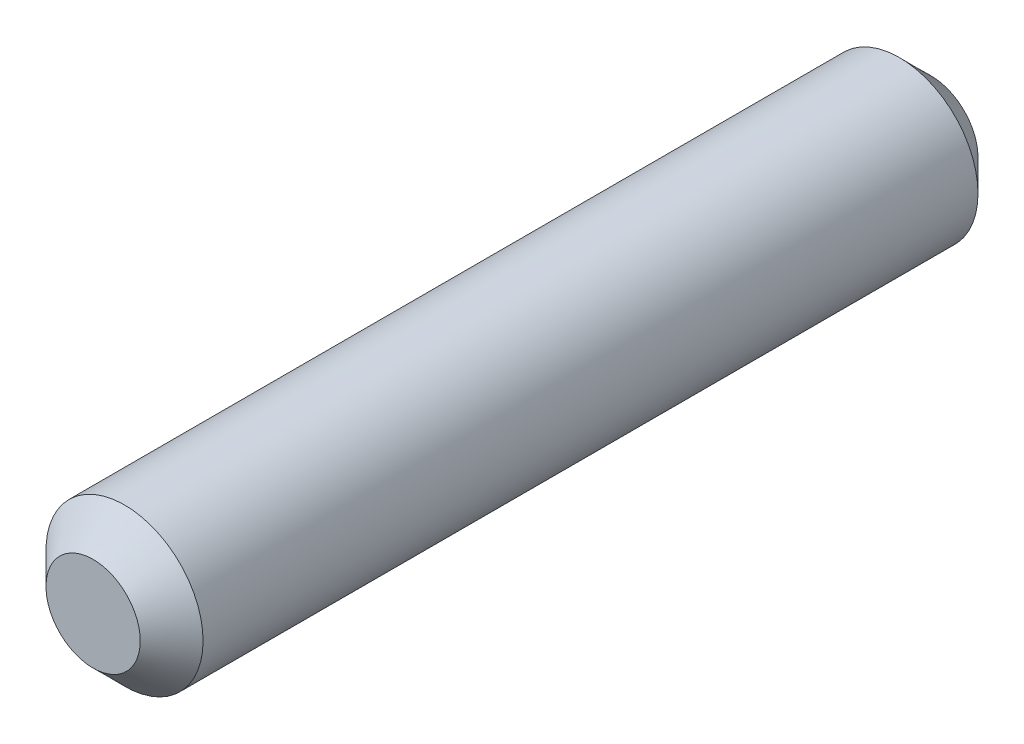
ISO-10303-21;
HEADER;
FILE_DESCRIPTION(('STEP AP214'),'2;1');
FILE_NAME('part.step','',(''),(''),'','','');
FILE_SCHEMA(('AUTOMOTIVE_DESIGN { 1 0 10303 214 1 1 1 1 }'));
ENDSEC;
DATA;
#1=APPLICATION_CONTEXT('core data for automotive mechanical design processes');
#2=APPLICATION_PROTOCOL_DEFINITION('international standard','automotive_design',2000,#1);
#3=PRODUCT_CONTEXT('',#1,'mechanical');
#4=PRODUCT('Part','Part','',(#3));
#5=PRODUCT_RELATED_PRODUCT_CATEGORY('part','',(#4));
#6=PRODUCT_DEFINITION_FORMATION('','',#4);
#7=PRODUCT_DEFINITION_CONTEXT('part definition',#1,'design');
#8=PRODUCT_DEFINITION('design','',#6,#7);
#9=PRODUCT_DEFINITION_SHAPE('','',#8);
#10=(LENGTH_UNIT() NAMED_UNIT(*) SI_UNIT(.MILLI.,.METRE.));
#11=(NAMED_UNIT(*) PLANE_ANGLE_UNIT() SI_UNIT($,.RADIAN.));
#12=(NAMED_UNIT(*) SI_UNIT($,.STERADIAN.) SOLID_ANGLE_UNIT());
#13=UNCERTAINTY_MEASURE_WITH_UNIT(LENGTH_MEASURE(1.E-05),#10,'distance_accuracy_value','');
#14=(GEOMETRIC_REPRESENTATION_CONTEXT(3) GLOBAL_UNCERTAINTY_ASSIGNED_CONTEXT((#13)) GLOBAL_UNIT_ASSIGNED_CONTEXT((#10,
#11,#12)) REPRESENTATION_CONTEXT('',''));
#15=CARTESIAN_POINT('',(0.,0.,0.));
#16=DIRECTION('',(0.,0.,1.));
#17=DIRECTION('',(1.,0.,0.));
#18=AXIS2_PLACEMENT_3D('',#15,#16,#17);
#19=CARTESIAN_POINT('',(0.,0.,16.));
#20=DIRECTION('',(0.,0.,-1.));
#21=DIRECTION('',(-1.,0.,0.));
#22=AXIS2_PLACEMENT_3D('',#19,#20,#21);
#23=CYLINDRICAL_SURFACE('',#22,1.5);
#24=CARTESIAN_POINT('',(0.,0.,0.600000000000002));
#25=DIRECTION('',(0.,0.,1.));
#26=DIRECTION('',(1.,0.,0.));
#27=AXIS2_PLACEMENT_3D('',#24,#25,#26);
#28=CIRCLE('',#27,1.5);
#29=CARTESIAN_POINT('',(1.5,0.,0.600000000000002));
#30=VERTEX_POINT('',#29);
#31=EDGE_CURVE('E49',#30,#30,#28,.T.);
#32=ORIENTED_EDGE('',*,*,#31,.T.);
#33=EDGE_LOOP('',(#32));
#34=FACE_BOUND('',#33,.T.);
#35=CARTESIAN_POINT('',(0.,0.,15.4));
#36=DIRECTION('',(0.,0.,1.));
#37=DIRECTION('',(1.,0.,0.));
#38=AXIS2_PLACEMENT_3D('',#35,#36,#37);
#39=CIRCLE('',#38,1.5);
#40=CARTESIAN_POINT('',(1.5,0.,15.4));
#41=VERTEX_POINT('',#40);
#42=EDGE_CURVE('E53',#41,#41,#39,.F.);
#43=ORIENTED_EDGE('',*,*,#42,.T.);
#44=EDGE_LOOP('',(#43));
#45=FACE_BOUND('',#44,.T.);
#46=ADVANCED_FACE('F37',(#34,#45),#23,.T.);
#47=CARTESIAN_POINT('',(0.,0.,16.));
#48=DIRECTION('',(0.,0.,1.));
#49=DIRECTION('',(1.,0.,0.));
#50=AXIS2_PLACEMENT_3D('',#47,#48,#49);
#51=PLANE('',#50);
#52=CARTESIAN_POINT('',(0.,0.,16.));
#53=DIRECTION('',(0.,0.,1.));
#54=DIRECTION('',(1.,0.,0.));
#55=AXIS2_PLACEMENT_3D('',#52,#53,#54);
#56=CIRCLE('',#55,0.900000000000003);
#57=CARTESIAN_POINT('',(0.900000000000003,0.,16.));
#58=VERTEX_POINT('',#57);
#59=EDGE_CURVE('E10',#58,#58,#56,.T.);
#60=ORIENTED_EDGE('',*,*,#59,.T.);
#61=EDGE_LOOP('',(#60));
#62=FACE_BOUND('',#61,.T.);
#63=ADVANCED_FACE('F69',(#62),#51,.T.);
#64=CARTESIAN_POINT('',(0.,0.,0.));
#65=DIRECTION('',(0.,0.,1.));
#66=DIRECTION('',(1.,0.,0.));
#67=AXIS2_PLACEMENT_3D('',#64,#65,#66);
#68=PLANE('',#67);
#69=CARTESIAN_POINT('',(0.,0.,0.));
#70=DIRECTION('',(0.,0.,1.));
#71=DIRECTION('',(1.,0.,0.));
#72=AXIS2_PLACEMENT_3D('',#69,#70,#71);
#73=CIRCLE('',#72,0.899999999999996);
#74=CARTESIAN_POINT('',(0.899999999999996,0.,0.));
#75=VERTEX_POINT('',#74);
#76=EDGE_CURVE('E45',#75,#75,#73,.F.);
#77=ORIENTED_EDGE('',*,*,#76,.T.);
#78=EDGE_LOOP('',(#77));
#79=FACE_BOUND('',#78,.T.);
#80=ADVANCED_FACE('F66',(#79),#68,.F.);
#81=CARTESIAN_POINT('',(0.,0.,0.600000000000002));
#82=DIRECTION('',(0.,0.,1.));
#83=DIRECTION('',(1.,0.,0.));
#84=AXIS2_PLACEMENT_3D('',#81,#82,#83);
#85=CONICAL_SURFACE('',#84,1.5,0.785398163397451);
#86=ORIENTED_EDGE('',*,*,#76,.F.);
#87=EDGE_LOOP('',(#86));
#88=FACE_BOUND('',#87,.T.);
#89=ORIENTED_EDGE('',*,*,#31,.F.);
#90=EDGE_LOOP('',(#89));
#91=FACE_BOUND('',#90,.T.);
#92=ADVANCED_FACE('F62',(#88,#91),#85,.T.);
#93=CARTESIAN_POINT('',(0.,0.,16.));
#94=DIRECTION('',(0.,0.,-1.));
#95=DIRECTION('',(-1.,0.,0.));
#96=AXIS2_PLACEMENT_3D('',#93,#94,#95);
#97=CONICAL_SURFACE('',#96,0.900000000000003,0.785398163397449);
#98=ORIENTED_EDGE('',*,*,#42,.F.);
#99=EDGE_LOOP('',(#98));
#100=FACE_BOUND('',#99,.T.);
#101=ORIENTED_EDGE('',*,*,#59,.F.);
#102=EDGE_LOOP('',(#101));
#103=FACE_BOUND('',#102,.T.);
#104=ADVANCED_FACE('F40',(#100,#103),#97,.T.);
#105=CLOSED_SHELL('',(#46,#63,#80,#92,#104));
#106=MANIFOLD_SOLID_BREP('B2',#105);
#107=ADVANCED_BREP_SHAPE_REPRESENTATION('',(#18,#106),#14);
#108=SHAPE_DEFINITION_REPRESENTATION(#9,#107);
ENDSEC;
END-ISO-10303-21;
